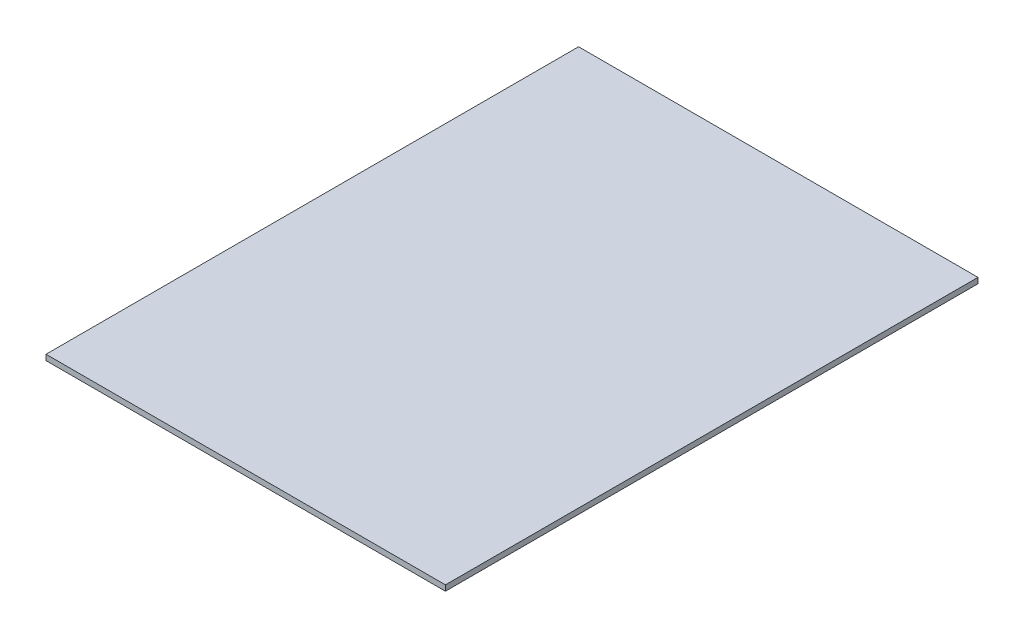
ISO-10303-21;
HEADER;
FILE_DESCRIPTION(('STEP AP214'),'2;1');
FILE_NAME('part.step','',(''),(''),'','','');
FILE_SCHEMA(('AUTOMOTIVE_DESIGN { 1 0 10303 214 1 1 1 1 }'));
ENDSEC;
DATA;
#1=APPLICATION_CONTEXT('core data for automotive mechanical design processes');
#2=APPLICATION_PROTOCOL_DEFINITION('international standard','automotive_design',2000,#1);
#3=PRODUCT_CONTEXT('',#1,'mechanical');
#4=PRODUCT('Part','Part','',(#3));
#5=PRODUCT_RELATED_PRODUCT_CATEGORY('part','',(#4));
#6=PRODUCT_DEFINITION_FORMATION('','',#4);
#7=PRODUCT_DEFINITION_CONTEXT('part definition',#1,'design');
#8=PRODUCT_DEFINITION('design','',#6,#7);
#9=PRODUCT_DEFINITION_SHAPE('','',#8);
#10=(LENGTH_UNIT() NAMED_UNIT(*) SI_UNIT(.MILLI.,.METRE.));
#11=(NAMED_UNIT(*) PLANE_ANGLE_UNIT() SI_UNIT($,.RADIAN.));
#12=(NAMED_UNIT(*) SI_UNIT($,.STERADIAN.) SOLID_ANGLE_UNIT());
#13=UNCERTAINTY_MEASURE_WITH_UNIT(LENGTH_MEASURE(1.E-05),#10,'distance_accuracy_value','');
#14=(GEOMETRIC_REPRESENTATION_CONTEXT(3) GLOBAL_UNCERTAINTY_ASSIGNED_CONTEXT((#13)) GLOBAL_UNIT_ASSIGNED_CONTEXT((#10,
#11,#12)) REPRESENTATION_CONTEXT('',''));
#15=CARTESIAN_POINT('',(0.,0.,0.));
#16=DIRECTION('',(0.,0.,1.));
#17=DIRECTION('',(1.,0.,0.));
#18=AXIS2_PLACEMENT_3D('',#15,#16,#17);
#19=CARTESIAN_POINT('',(-228.407580304894,-6.35,183.414923849436));
#20=DIRECTION('',(-1.,0.,0.));
#21=DIRECTION('',(0.,0.,1.));
#22=AXIS2_PLACEMENT_3D('',#19,#20,#21);
#23=PLANE('',#22);
#24=DIRECTION('',(0.,0.,1.));
#25=VECTOR('',#24,1.);
#26=CARTESIAN_POINT('',(-228.407580304894,0.,183.414923849436));
#27=LINE('',#26,#25);
#28=CARTESIAN_POINT('',(-228.407580304894,0.,183.414923849436));
#29=VERTEX_POINT('',#28);
#30=CARTESIAN_POINT('',(-228.407580304894,0.,793.014923849435));
#31=VERTEX_POINT('',#30);
#32=EDGE_CURVE('E106',#29,#31,#27,.T.);
#33=ORIENTED_EDGE('',*,*,#32,.F.);
#34=DIRECTION('',(0.,1.,0.));
#35=VECTOR('',#34,1.);
#36=CARTESIAN_POINT('',(-228.407580304894,-6.35,183.414923849436));
#37=LINE('',#36,#35);
#38=CARTESIAN_POINT('',(-228.407580304894,-6.35,183.414923849436));
#39=VERTEX_POINT('',#38);
#40=EDGE_CURVE('E11',#39,#29,#37,.T.);
#41=ORIENTED_EDGE('',*,*,#40,.F.);
#42=DIRECTION('',(0.,0.,1.));
#43=VECTOR('',#42,1.);
#44=CARTESIAN_POINT('',(-228.407580304894,-6.35,183.414923849436));
#45=LINE('',#44,#43);
#46=CARTESIAN_POINT('',(-228.407580304894,-6.35,793.014923849435));
#47=VERTEX_POINT('',#46);
#48=EDGE_CURVE('E100',#39,#47,#45,.T.);
#49=ORIENTED_EDGE('',*,*,#48,.T.);
#50=DIRECTION('',(0.,1.,0.));
#51=VECTOR('',#50,1.);
#52=CARTESIAN_POINT('',(-228.407580304894,-6.35,793.014923849435));
#53=LINE('',#52,#51);
#54=EDGE_CURVE('E43',#47,#31,#53,.T.);
#55=ORIENTED_EDGE('',*,*,#54,.T.);
#56=EDGE_LOOP('',(#33,#41,#49,#55));
#57=FACE_BOUND('',#56,.T.);
#58=ADVANCED_FACE('F40',(#57),#23,.T.);
#59=CARTESIAN_POINT('',(-228.407580304894,-6.35,183.414923849436));
#60=DIRECTION('',(0.,0.,1.));
#61=DIRECTION('',(1.,0.,0.));
#62=AXIS2_PLACEMENT_3D('',#59,#60,#61);
#63=PLANE('',#62);
#64=DIRECTION('',(1.,0.,0.));
#65=VECTOR('',#64,1.);
#66=CARTESIAN_POINT('',(-228.407580304894,0.,183.414923849436));
#67=LINE('',#66,#65);
#68=CARTESIAN_POINT('',(228.792419695106,0.,183.414923849436));
#69=VERTEX_POINT('',#68);
#70=EDGE_CURVE('E73',#29,#69,#67,.T.);
#71=ORIENTED_EDGE('',*,*,#70,.T.);
#72=DIRECTION('',(0.,1.,0.));
#73=VECTOR('',#72,1.);
#74=CARTESIAN_POINT('',(228.792419695106,-6.35,183.414923849436));
#75=LINE('',#74,#73);
#76=CARTESIAN_POINT('',(228.792419695106,-6.35,183.414923849436));
#77=VERTEX_POINT('',#76);
#78=EDGE_CURVE('E49',#77,#69,#75,.T.);
#79=ORIENTED_EDGE('',*,*,#78,.F.);
#80=DIRECTION('',(1.,0.,0.));
#81=VECTOR('',#80,1.);
#82=CARTESIAN_POINT('',(-228.407580304894,-6.35,183.414923849436));
#83=LINE('',#82,#81);
#84=EDGE_CURVE('E90',#39,#77,#83,.T.);
#85=ORIENTED_EDGE('',*,*,#84,.F.);
#86=ORIENTED_EDGE('',*,*,#40,.T.);
#87=EDGE_LOOP('',(#71,#79,#85,#86));
#88=FACE_BOUND('',#87,.T.);
#89=ADVANCED_FACE('F116',(#88),#63,.F.);
#90=CARTESIAN_POINT('',(228.792419695106,-6.35,183.414923849436));
#91=DIRECTION('',(-1.,0.,0.));
#92=DIRECTION('',(0.,0.,1.));
#93=AXIS2_PLACEMENT_3D('',#90,#91,#92);
#94=PLANE('',#93);
#95=DIRECTION('',(0.,0.,1.));
#96=VECTOR('',#95,1.);
#97=CARTESIAN_POINT('',(228.792419695106,0.,183.414923849436));
#98=LINE('',#97,#96);
#99=CARTESIAN_POINT('',(228.792419695106,0.,793.014923849435));
#100=VERTEX_POINT('',#99);
#101=EDGE_CURVE('E97',#69,#100,#98,.T.);
#102=ORIENTED_EDGE('',*,*,#101,.T.);
#103=DIRECTION('',(0.,1.,0.));
#104=VECTOR('',#103,1.);
#105=CARTESIAN_POINT('',(228.792419695106,-6.35,793.014923849435));
#106=LINE('',#105,#104);
#107=CARTESIAN_POINT('',(228.792419695106,-6.35,793.014923849435));
#108=VERTEX_POINT('',#107);
#109=EDGE_CURVE('E94',#108,#100,#106,.T.);
#110=ORIENTED_EDGE('',*,*,#109,.F.);
#111=DIRECTION('',(0.,0.,1.));
#112=VECTOR('',#111,1.);
#113=CARTESIAN_POINT('',(228.792419695106,-6.35,183.414923849436));
#114=LINE('',#113,#112);
#115=EDGE_CURVE('E85',#77,#108,#114,.T.);
#116=ORIENTED_EDGE('',*,*,#115,.F.);
#117=ORIENTED_EDGE('',*,*,#78,.T.);
#118=EDGE_LOOP('',(#102,#110,#116,#117));
#119=FACE_BOUND('',#118,.T.);
#120=ADVANCED_FACE('F95',(#119),#94,.F.);
#121=CARTESIAN_POINT('',(-228.407580304894,-6.35,793.014923849435));
#122=DIRECTION('',(0.,0.,1.));
#123=DIRECTION('',(1.,0.,0.));
#124=AXIS2_PLACEMENT_3D('',#121,#122,#123);
#125=PLANE('',#124);
#126=DIRECTION('',(1.,0.,0.));
#127=VECTOR('',#126,1.);
#128=CARTESIAN_POINT('',(-228.407580304894,0.,793.014923849435));
#129=LINE('',#128,#127);
#130=EDGE_CURVE('E109',#31,#100,#129,.T.);
#131=ORIENTED_EDGE('',*,*,#130,.F.);
#132=ORIENTED_EDGE('',*,*,#54,.F.);
#133=DIRECTION('',(1.,0.,0.));
#134=VECTOR('',#133,1.);
#135=CARTESIAN_POINT('',(-228.407580304894,-6.35,793.014923849435));
#136=LINE('',#135,#134);
#137=EDGE_CURVE('E89',#47,#108,#136,.T.);
#138=ORIENTED_EDGE('',*,*,#137,.T.);
#139=ORIENTED_EDGE('',*,*,#109,.T.);
#140=EDGE_LOOP('',(#131,#132,#138,#139));
#141=FACE_BOUND('',#140,.T.);
#142=ADVANCED_FACE('F99',(#141),#125,.T.);
#143=CARTESIAN_POINT('',(0.,-6.35,0.));
#144=DIRECTION('',(0.,1.,0.));
#145=DIRECTION('',(0.,0.,1.));
#146=AXIS2_PLACEMENT_3D('',#143,#144,#145);
#147=PLANE('',#146);
#148=ORIENTED_EDGE('',*,*,#48,.F.);
#149=ORIENTED_EDGE('',*,*,#84,.T.);
#150=ORIENTED_EDGE('',*,*,#115,.T.);
#151=ORIENTED_EDGE('',*,*,#137,.F.);
#152=EDGE_LOOP('',(#148,#149,#150,#151));
#153=FACE_BOUND('',#152,.T.);
#154=ADVANCED_FACE('F88',(#153),#147,.F.);
#155=CARTESIAN_POINT('',(0.,0.,0.));
#156=DIRECTION('',(0.,1.,0.));
#157=DIRECTION('',(0.,0.,1.));
#158=AXIS2_PLACEMENT_3D('',#155,#156,#157);
#159=PLANE('',#158);
#160=ORIENTED_EDGE('',*,*,#32,.T.);
#161=ORIENTED_EDGE('',*,*,#130,.T.);
#162=ORIENTED_EDGE('',*,*,#101,.F.);
#163=ORIENTED_EDGE('',*,*,#70,.F.);
#164=EDGE_LOOP('',(#160,#161,#162,#163));
#165=FACE_BOUND('',#164,.T.);
#166=ADVANCED_FACE('F114',(#165),#159,.T.);
#167=CLOSED_SHELL('',(#58,#89,#120,#142,#154,#166));
#168=MANIFOLD_SOLID_BREP('B2',#167);
#169=ADVANCED_BREP_SHAPE_REPRESENTATION('',(#18,#168),#14);
#170=SHAPE_DEFINITION_REPRESENTATION(#9,#169);
ENDSEC;
END-ISO-10303-21;
